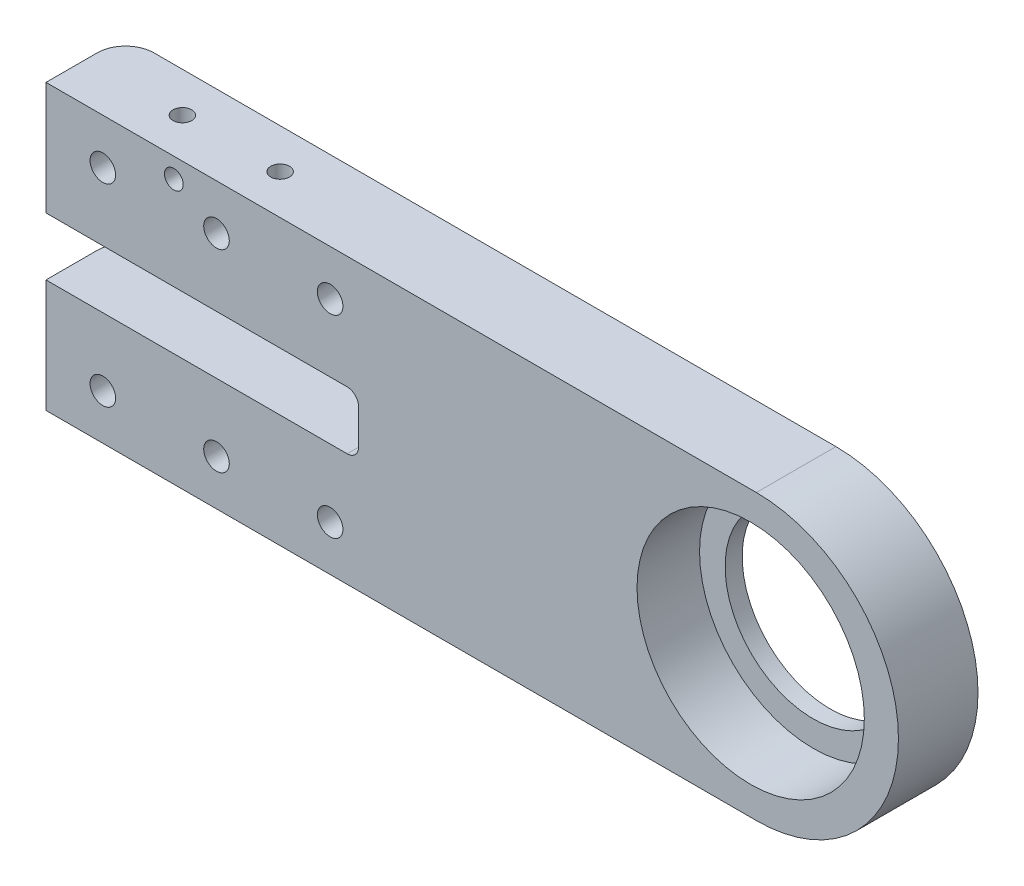
ISO-10303-21;
HEADER;
FILE_DESCRIPTION(('STEP AP214'),'2;1');
FILE_NAME('part.step','',(''),(''),'','','');
FILE_SCHEMA(('AUTOMOTIVE_DESIGN { 1 0 10303 214 1 1 1 1 }'));
ENDSEC;
DATA;
#1=APPLICATION_CONTEXT('core data for automotive mechanical design processes');
#2=APPLICATION_PROTOCOL_DEFINITION('international standard','automotive_design',2000,#1);
#3=PRODUCT_CONTEXT('',#1,'mechanical');
#4=PRODUCT('Part','Part','',(#3));
#5=PRODUCT_RELATED_PRODUCT_CATEGORY('part','',(#4));
#6=PRODUCT_DEFINITION_FORMATION('','',#4);
#7=PRODUCT_DEFINITION_CONTEXT('part definition',#1,'design');
#8=PRODUCT_DEFINITION('design','',#6,#7);
#9=PRODUCT_DEFINITION_SHAPE('','',#8);
#10=(LENGTH_UNIT() NAMED_UNIT(*) SI_UNIT(.MILLI.,.METRE.));
#11=(NAMED_UNIT(*) PLANE_ANGLE_UNIT() SI_UNIT($,.RADIAN.));
#12=(NAMED_UNIT(*) SI_UNIT($,.STERADIAN.) SOLID_ANGLE_UNIT());
#13=UNCERTAINTY_MEASURE_WITH_UNIT(LENGTH_MEASURE(1.E-05),#10,'distance_accuracy_value','');
#14=(GEOMETRIC_REPRESENTATION_CONTEXT(3) GLOBAL_UNCERTAINTY_ASSIGNED_CONTEXT((#13)) GLOBAL_UNIT_ASSIGNED_CONTEXT((#10,
#11,#12)) REPRESENTATION_CONTEXT('',''));
#15=CARTESIAN_POINT('',(0.,0.,0.));
#16=DIRECTION('',(0.,0.,1.));
#17=DIRECTION('',(1.,0.,0.));
#18=AXIS2_PLACEMENT_3D('',#15,#16,#17);
#19=CARTESIAN_POINT('',(0.,-50.,14.));
#20=DIRECTION('',(-1.,0.,0.));
#21=DIRECTION('',(0.,-1.,0.));
#22=AXIS2_PLACEMENT_3D('',#19,#20,#21);
#23=PLANE('',#22);
#24=DIRECTION('',(0.,0.,-1.));
#25=VECTOR('',#24,1.);
#26=CARTESIAN_POINT('',(0.,0.,14.));
#27=LINE('',#26,#25);
#28=CARTESIAN_POINT('',(0.,0.,14.));
#29=VERTEX_POINT('',#28);
#30=CARTESIAN_POINT('',(0.,0.,5.));
#31=VERTEX_POINT('',#30);
#32=EDGE_CURVE('E172',#29,#31,#27,.T.);
#33=ORIENTED_EDGE('',*,*,#32,.T.);
#34=DIRECTION('',(0.,1.,0.));
#35=VECTOR('',#34,1.);
#36=CARTESIAN_POINT('',(0.,-50.,5.));
#37=LINE('',#36,#35);
#38=CARTESIAN_POINT('',(0.,-19.8999999994651,5.));
#39=VERTEX_POINT('',#38);
#40=EDGE_CURVE('E40',#31,#39,#37,.F.);
#41=ORIENTED_EDGE('',*,*,#40,.T.);
#42=DIRECTION('',(0.,0.,1.));
#43=VECTOR('',#42,1.);
#44=CARTESIAN_POINT('',(0.,-19.8999999994651,0.));
#45=LINE('',#44,#43);
#46=CARTESIAN_POINT('',(0.,-19.8999999994651,14.));
#47=VERTEX_POINT('',#46);
#48=EDGE_CURVE('E131',#39,#47,#45,.T.);
#49=ORIENTED_EDGE('',*,*,#48,.T.);
#50=DIRECTION('',(0.,1.,0.));
#51=VECTOR('',#50,1.);
#52=CARTESIAN_POINT('',(0.,-50.,14.));
#53=LINE('',#52,#51);
#54=EDGE_CURVE('E150',#47,#29,#53,.T.);
#55=ORIENTED_EDGE('',*,*,#54,.T.);
#56=EDGE_LOOP('',(#33,#41,#49,#55));
#57=FACE_BOUND('',#56,.T.);
#58=ADVANCED_FACE('F32',(#57),#23,.T.);
#59=CARTESIAN_POINT('',(125.,-25.,14.));
#60=DIRECTION('',(0.,0.,-1.));
#61=DIRECTION('',(-1.,0.,0.));
#62=AXIS2_PLACEMENT_3D('',#59,#60,#61);
#63=CYLINDRICAL_SURFACE('',#62,25.);
#64=CARTESIAN_POINT('',(125.,-25.,0.));
#65=DIRECTION('',(0.,0.,-1.));
#66=DIRECTION('',(-1.,0.,0.));
#67=AXIS2_PLACEMENT_3D('',#64,#65,#66);
#68=CIRCLE('',#67,25.);
#69=CARTESIAN_POINT('',(125.,0.,0.));
#70=VERTEX_POINT('',#69);
#71=CARTESIAN_POINT('',(125.,-50.,0.));
#72=VERTEX_POINT('',#71);
#73=EDGE_CURVE('E159',#70,#72,#68,.T.);
#74=ORIENTED_EDGE('',*,*,#73,.F.);
#75=DIRECTION('',(0.,0.,-1.));
#76=VECTOR('',#75,1.);
#77=CARTESIAN_POINT('',(125.,0.,14.));
#78=LINE('',#77,#76);
#79=CARTESIAN_POINT('',(125.,0.,14.));
#80=VERTEX_POINT('',#79);
#81=EDGE_CURVE('E168',#80,#70,#78,.T.);
#82=ORIENTED_EDGE('',*,*,#81,.F.);
#83=CARTESIAN_POINT('',(125.,-25.,14.));
#84=DIRECTION('',(0.,0.,-1.));
#85=DIRECTION('',(-1.,0.,0.));
#86=AXIS2_PLACEMENT_3D('',#83,#84,#85);
#87=CIRCLE('',#86,25.);
#88=CARTESIAN_POINT('',(125.,-50.,14.));
#89=VERTEX_POINT('',#88);
#90=EDGE_CURVE('E167',#80,#89,#87,.T.);
#91=ORIENTED_EDGE('',*,*,#90,.T.);
#92=DIRECTION('',(0.,0.,-1.));
#93=VECTOR('',#92,1.);
#94=CARTESIAN_POINT('',(125.,-50.,14.));
#95=LINE('',#94,#93);
#96=EDGE_CURVE('E153',#89,#72,#95,.T.);
#97=ORIENTED_EDGE('',*,*,#96,.T.);
#98=EDGE_LOOP('',(#74,#82,#91,#97));
#99=FACE_BOUND('',#98,.T.);
#100=ADVANCED_FACE('F260',(#99),#63,.T.);
#101=CARTESIAN_POINT('',(0.,0.,14.));
#102=DIRECTION('',(0.,1.,0.));
#103=DIRECTION('',(0.,0.,1.));
#104=AXIS2_PLACEMENT_3D('',#101,#102,#103);
#105=PLANE('',#104);
#106=CARTESIAN_POINT('',(17.,0.,7.00000000000001));
#107=DIRECTION('',(0.,1.,0.));
#108=DIRECTION('',(0.,0.,1.));
#109=AXIS2_PLACEMENT_3D('',#106,#107,#108);
#110=CIRCLE('',#109,1.64999999999998);
#111=CARTESIAN_POINT('',(17.,0.,8.64999999999999));
#112=VERTEX_POINT('',#111);
#113=EDGE_CURVE('E367',#112,#112,#110,.T.);
#114=ORIENTED_EDGE('',*,*,#113,.F.);
#115=EDGE_LOOP('',(#114));
#116=FACE_BOUND('',#115,.T.);
#117=CARTESIAN_POINT('',(34.2,0.,7.00000000000001));
#118=DIRECTION('',(0.,1.,0.));
#119=DIRECTION('',(0.,0.,1.));
#120=AXIS2_PLACEMENT_3D('',#117,#118,#119);
#121=CIRCLE('',#120,1.64999999999998);
#122=CARTESIAN_POINT('',(34.2,0.,8.64999999999999));
#123=VERTEX_POINT('',#122);
#124=EDGE_CURVE('E373',#123,#123,#121,.T.);
#125=ORIENTED_EDGE('',*,*,#124,.F.);
#126=EDGE_LOOP('',(#125));
#127=FACE_BOUND('',#126,.T.);
#128=DIRECTION('',(1.,0.,0.));
#129=VECTOR('',#128,1.);
#130=CARTESIAN_POINT('',(0.,0.,0.));
#131=LINE('',#130,#129);
#132=CARTESIAN_POINT('',(5.,0.,0.));
#133=VERTEX_POINT('',#132);
#134=EDGE_CURVE('E165',#133,#70,#131,.T.);
#135=ORIENTED_EDGE('',*,*,#134,.F.);
#136=CARTESIAN_POINT('',(5.,0.,5.));
#137=DIRECTION('',(0.,1.,0.));
#138=DIRECTION('',(0.,0.,1.));
#139=AXIS2_PLACEMENT_3D('',#136,#137,#138);
#140=CIRCLE('',#139,5.);
#141=EDGE_CURVE('E54',#133,#31,#140,.T.);
#142=ORIENTED_EDGE('',*,*,#141,.T.);
#143=ORIENTED_EDGE('',*,*,#32,.F.);
#144=DIRECTION('',(1.,0.,0.));
#145=VECTOR('',#144,1.);
#146=CARTESIAN_POINT('',(0.,0.,14.));
#147=LINE('',#146,#145);
#148=EDGE_CURVE('E149',#29,#80,#147,.T.);
#149=ORIENTED_EDGE('',*,*,#148,.T.);
#150=ORIENTED_EDGE('',*,*,#81,.T.);
#151=EDGE_LOOP('',(#135,#142,#143,#149,#150));
#152=FACE_BOUND('',#151,.T.);
#153=ADVANCED_FACE('F265',(#116,#127,#152),#105,.T.);
#154=DIRECTION('',(0.,0.,1.));
#155=VECTOR('',#154,1.);
#156=CARTESIAN_POINT('',(0.,-30.0999999994651,0.));
#157=LINE('',#156,#155);
#158=CARTESIAN_POINT('',(0.,-30.0999999994651,5.));
#159=VERTEX_POINT('',#158);
#160=CARTESIAN_POINT('',(0.,-30.0999999994651,14.));
#161=VERTEX_POINT('',#160);
#162=EDGE_CURVE('E120',#159,#161,#157,.T.);
#163=ORIENTED_EDGE('',*,*,#162,.F.);
#164=DIRECTION('',(0.,1.,0.));
#165=VECTOR('',#164,1.);
#166=CARTESIAN_POINT('',(0.,-50.,5.));
#167=LINE('',#166,#165);
#168=CARTESIAN_POINT('',(0.,-50.,5.));
#169=VERTEX_POINT('',#168);
#170=EDGE_CURVE('E235',#159,#169,#167,.F.);
#171=ORIENTED_EDGE('',*,*,#170,.T.);
#172=DIRECTION('',(0.,0.,-1.));
#173=VECTOR('',#172,1.);
#174=CARTESIAN_POINT('',(0.,-50.,14.));
#175=LINE('',#174,#173);
#176=CARTESIAN_POINT('',(0.,-50.,14.));
#177=VERTEX_POINT('',#176);
#178=EDGE_CURVE('E148',#177,#169,#175,.T.);
#179=ORIENTED_EDGE('',*,*,#178,.F.);
#180=EDGE_CURVE('E139',#177,#161,#53,.T.);
#181=ORIENTED_EDGE('',*,*,#180,.T.);
#182=EDGE_LOOP('',(#163,#171,#179,#181));
#183=FACE_BOUND('',#182,.T.);
#184=ADVANCED_FACE('F146',(#183),#23,.T.);
#185=CARTESIAN_POINT('',(125.,-50.,14.));
#186=DIRECTION('',(0.,-1.,0.));
#187=DIRECTION('',(0.,0.,-1.));
#188=AXIS2_PLACEMENT_3D('',#185,#186,#187);
#189=PLANE('',#188);
#190=ORIENTED_EDGE('',*,*,#178,.T.);
#191=CARTESIAN_POINT('',(5.00000000000001,-50.,5.));
#192=DIRECTION('',(0.,-1.,0.));
#193=DIRECTION('',(0.,0.,-1.));
#194=AXIS2_PLACEMENT_3D('',#191,#192,#193);
#195=CIRCLE('',#194,5.);
#196=CARTESIAN_POINT('',(5.,-50.,0.));
#197=VERTEX_POINT('',#196);
#198=EDGE_CURVE('E237',#169,#197,#195,.T.);
#199=ORIENTED_EDGE('',*,*,#198,.T.);
#200=DIRECTION('',(-1.,0.,0.));
#201=VECTOR('',#200,1.);
#202=CARTESIAN_POINT('',(125.,-50.,0.));
#203=LINE('',#202,#201);
#204=EDGE_CURVE('E162',#72,#197,#203,.T.);
#205=ORIENTED_EDGE('',*,*,#204,.F.);
#206=ORIENTED_EDGE('',*,*,#96,.F.);
#207=DIRECTION('',(-1.,0.,0.));
#208=VECTOR('',#207,1.);
#209=CARTESIAN_POINT('',(125.,-50.,14.));
#210=LINE('',#209,#208);
#211=EDGE_CURVE('E155',#89,#177,#210,.T.);
#212=ORIENTED_EDGE('',*,*,#211,.T.);
#213=EDGE_LOOP('',(#190,#199,#205,#206,#212));
#214=FACE_BOUND('',#213,.T.);
#215=ADVANCED_FACE('F242',(#214),#189,.T.);
#216=CARTESIAN_POINT('',(125.,-25.,14.));
#217=DIRECTION('',(0.,0.,-1.));
#218=DIRECTION('',(-1.,0.,0.));
#219=AXIS2_PLACEMENT_3D('',#216,#217,#218);
#220=PLANE('',#219);
#221=CARTESIAN_POINT('',(123.999999994871,-24.9999999994651,14.));
#222=DIRECTION('',(0.,0.,1.));
#223=DIRECTION('',(1.,0.,0.));
#224=AXIS2_PLACEMENT_3D('',#221,#222,#223);
#225=CIRCLE('',#224,20.0000000051291);
#226=CARTESIAN_POINT('',(144.,-24.9999999994651,14.));
#227=VERTEX_POINT('',#226);
#228=EDGE_CURVE('E357',#227,#227,#225,.T.);
#229=ORIENTED_EDGE('',*,*,#228,.F.);
#230=EDGE_LOOP('',(#229));
#231=FACE_BOUND('',#230,.T.);
#232=CARTESIAN_POINT('',(22.5,-3.5,14.));
#233=DIRECTION('',(0.,0.,1.));
#234=DIRECTION('',(1.,0.,0.));
#235=AXIS2_PLACEMENT_3D('',#232,#233,#234);
#236=CIRCLE('',#235,1.64999999999998);
#237=CARTESIAN_POINT('',(24.15,-3.5,14.));
#238=VERTEX_POINT('',#237);
#239=EDGE_CURVE('E379',#238,#238,#236,.T.);
#240=ORIENTED_EDGE('',*,*,#239,.F.);
#241=EDGE_LOOP('',(#240));
#242=FACE_BOUND('',#241,.T.);
#243=CARTESIAN_POINT('',(10.,-8.,14.));
#244=DIRECTION('',(0.,0.,-1.));
#245=DIRECTION('',(-1.,0.,0.));
#246=AXIS2_PLACEMENT_3D('',#243,#244,#245);
#247=CIRCLE('',#246,2.24999999999997);
#248=CARTESIAN_POINT('',(7.75000000000003,-8.,14.));
#249=VERTEX_POINT('',#248);
#250=EDGE_CURVE('E385',#249,#249,#247,.T.);
#251=ORIENTED_EDGE('',*,*,#250,.T.);
#252=EDGE_LOOP('',(#251));
#253=FACE_BOUND('',#252,.T.);
#254=CARTESIAN_POINT('',(9.99999999999998,-42.,14.));
#255=DIRECTION('',(0.,0.,-1.));
#256=DIRECTION('',(-1.,0.,0.));
#257=AXIS2_PLACEMENT_3D('',#254,#255,#256);
#258=CIRCLE('',#257,2.24999999999997);
#259=CARTESIAN_POINT('',(7.75000000000002,-42.,14.));
#260=VERTEX_POINT('',#259);
#261=EDGE_CURVE('E388',#260,#260,#258,.T.);
#262=ORIENTED_EDGE('',*,*,#261,.T.);
#263=EDGE_LOOP('',(#262));
#264=FACE_BOUND('',#263,.T.);
#265=CARTESIAN_POINT('',(30.,-42.,14.));
#266=DIRECTION('',(0.,0.,-1.));
#267=DIRECTION('',(-1.,0.,0.));
#268=AXIS2_PLACEMENT_3D('',#265,#266,#267);
#269=CIRCLE('',#268,2.24999999999997);
#270=CARTESIAN_POINT('',(27.75,-42.,14.));
#271=VERTEX_POINT('',#270);
#272=EDGE_CURVE('E391',#271,#271,#269,.T.);
#273=ORIENTED_EDGE('',*,*,#272,.T.);
#274=EDGE_LOOP('',(#273));
#275=FACE_BOUND('',#274,.T.);
#276=CARTESIAN_POINT('',(30.,-8.,14.));
#277=DIRECTION('',(0.,0.,-1.));
#278=DIRECTION('',(-1.,0.,0.));
#279=AXIS2_PLACEMENT_3D('',#276,#277,#278);
#280=CIRCLE('',#279,2.24999999999996);
#281=CARTESIAN_POINT('',(27.75,-8.,14.));
#282=VERTEX_POINT('',#281);
#283=EDGE_CURVE('E394',#282,#282,#280,.T.);
#284=ORIENTED_EDGE('',*,*,#283,.T.);
#285=EDGE_LOOP('',(#284));
#286=FACE_BOUND('',#285,.T.);
#287=CARTESIAN_POINT('',(50.,-8.00000000000001,14.));
#288=DIRECTION('',(0.,0.,-1.));
#289=DIRECTION('',(-1.,0.,0.));
#290=AXIS2_PLACEMENT_3D('',#287,#288,#289);
#291=CIRCLE('',#290,2.24999999999997);
#292=CARTESIAN_POINT('',(47.75,-8.00000000000001,14.));
#293=VERTEX_POINT('',#292);
#294=EDGE_CURVE('E397',#293,#293,#291,.T.);
#295=ORIENTED_EDGE('',*,*,#294,.T.);
#296=EDGE_LOOP('',(#295));
#297=FACE_BOUND('',#296,.T.);
#298=CARTESIAN_POINT('',(50.,-42.,14.));
#299=DIRECTION('',(0.,0.,-1.));
#300=DIRECTION('',(-1.,0.,0.));
#301=AXIS2_PLACEMENT_3D('',#298,#299,#300);
#302=CIRCLE('',#301,2.24999999999997);
#303=CARTESIAN_POINT('',(47.75,-42.,14.));
#304=VERTEX_POINT('',#303);
#305=EDGE_CURVE('E144',#304,#304,#302,.T.);
#306=ORIENTED_EDGE('',*,*,#305,.T.);
#307=EDGE_LOOP('',(#306));
#308=FACE_BOUND('',#307,.T.);
#309=ORIENTED_EDGE('',*,*,#54,.F.);
#310=DIRECTION('',(-1.,0.,0.));
#311=VECTOR('',#310,1.);
#312=CARTESIAN_POINT('',(55.,-19.8999999994651,14.));
#313=LINE('',#312,#311);
#314=CARTESIAN_POINT('',(53.,-19.8999999994651,14.));
#315=VERTEX_POINT('',#314);
#316=EDGE_CURVE('E405',#315,#47,#313,.T.);
#317=ORIENTED_EDGE('',*,*,#316,.F.);
#318=CARTESIAN_POINT('',(53.,-21.8999999994651,14.));
#319=DIRECTION('',(0.,0.,-1.));
#320=DIRECTION('',(-1.,0.,0.));
#321=AXIS2_PLACEMENT_3D('',#318,#319,#320);
#322=CIRCLE('',#321,2.);
#323=CARTESIAN_POINT('',(55.,-21.8999999994651,14.));
#324=VERTEX_POINT('',#323);
#325=EDGE_CURVE('E221',#315,#324,#322,.T.);
#326=ORIENTED_EDGE('',*,*,#325,.T.);
#327=DIRECTION('',(0.,1.,0.));
#328=VECTOR('',#327,1.);
#329=CARTESIAN_POINT('',(55.,-30.0999999994651,14.));
#330=LINE('',#329,#328);
#331=CARTESIAN_POINT('',(55.,-28.0999999994651,14.));
#332=VERTEX_POINT('',#331);
#333=EDGE_CURVE('E143',#332,#324,#330,.T.);
#334=ORIENTED_EDGE('',*,*,#333,.F.);
#335=CARTESIAN_POINT('',(53.,-28.0999999994651,14.));
#336=DIRECTION('',(0.,0.,-1.));
#337=DIRECTION('',(-1.,0.,0.));
#338=AXIS2_PLACEMENT_3D('',#335,#336,#337);
#339=CIRCLE('',#338,2.);
#340=CARTESIAN_POINT('',(53.,-30.0999999994651,14.));
#341=VERTEX_POINT('',#340);
#342=EDGE_CURVE('E142',#332,#341,#339,.T.);
#343=ORIENTED_EDGE('',*,*,#342,.T.);
#344=DIRECTION('',(1.,0.,0.));
#345=VECTOR('',#344,1.);
#346=CARTESIAN_POINT('',(0.,-30.0999999994651,14.));
#347=LINE('',#346,#345);
#348=EDGE_CURVE('E125',#161,#341,#347,.T.);
#349=ORIENTED_EDGE('',*,*,#348,.F.);
#350=ORIENTED_EDGE('',*,*,#180,.F.);
#351=ORIENTED_EDGE('',*,*,#211,.F.);
#352=ORIENTED_EDGE('',*,*,#90,.F.);
#353=ORIENTED_EDGE('',*,*,#148,.F.);
#354=EDGE_LOOP('',(#309,#317,#326,#334,#343,#349,#350,#351,#352,#353));
#355=FACE_BOUND('',#354,.T.);
#356=ADVANCED_FACE('F137',(#231,#242,#253,#264,#275,#286,#297,#308,#355),#220,.F.);
#357=CARTESIAN_POINT('',(125.,-25.,0.));
#358=DIRECTION('',(0.,0.,-1.));
#359=DIRECTION('',(-1.,0.,0.));
#360=AXIS2_PLACEMENT_3D('',#357,#358,#359);
#361=PLANE('',#360);
#362=CARTESIAN_POINT('',(30.,-42.,0.));
#363=DIRECTION('',(0.,0.,-1.));
#364=DIRECTION('',(-1.,0.,0.));
#365=AXIS2_PLACEMENT_3D('',#362,#363,#364);
#366=CIRCLE('',#365,4.70000000001612);
#367=CARTESIAN_POINT('',(25.2999999999839,-42.,0.));
#368=VERTEX_POINT('',#367);
#369=EDGE_CURVE('E193',#368,#368,#366,.F.);
#370=ORIENTED_EDGE('',*,*,#369,.T.);
#371=EDGE_LOOP('',(#370));
#372=FACE_BOUND('',#371,.T.);
#373=CARTESIAN_POINT('',(9.99999999999998,-42.,0.));
#374=DIRECTION('',(0.,0.,-1.));
#375=DIRECTION('',(-1.,0.,0.));
#376=AXIS2_PLACEMENT_3D('',#373,#374,#375);
#377=CIRCLE('',#376,4.70000000001608);
#378=CARTESIAN_POINT('',(5.2999999999839,-42.,0.));
#379=VERTEX_POINT('',#378);
#380=EDGE_CURVE('E190',#379,#379,#377,.F.);
#381=ORIENTED_EDGE('',*,*,#380,.T.);
#382=EDGE_LOOP('',(#381));
#383=FACE_BOUND('',#382,.T.);
#384=CARTESIAN_POINT('',(50.,-42.,0.));
#385=DIRECTION('',(0.,0.,-1.));
#386=DIRECTION('',(-1.,0.,0.));
#387=AXIS2_PLACEMENT_3D('',#384,#385,#386);
#388=CIRCLE('',#387,4.70000000001608);
#389=CARTESIAN_POINT('',(45.2999999999839,-42.,0.));
#390=VERTEX_POINT('',#389);
#391=EDGE_CURVE('E187',#390,#390,#388,.F.);
#392=ORIENTED_EDGE('',*,*,#391,.T.);
#393=EDGE_LOOP('',(#392));
#394=FACE_BOUND('',#393,.T.);
#395=CARTESIAN_POINT('',(30.,-8.,0.));
#396=DIRECTION('',(0.,0.,-1.));
#397=DIRECTION('',(-1.,0.,0.));
#398=AXIS2_PLACEMENT_3D('',#395,#396,#397);
#399=CIRCLE('',#398,4.70000000001607);
#400=CARTESIAN_POINT('',(25.2999999999839,-8.,0.));
#401=VERTEX_POINT('',#400);
#402=EDGE_CURVE('E184',#401,#401,#399,.F.);
#403=ORIENTED_EDGE('',*,*,#402,.T.);
#404=EDGE_LOOP('',(#403));
#405=FACE_BOUND('',#404,.T.);
#406=CARTESIAN_POINT('',(10.,-8.,0.));
#407=DIRECTION('',(0.,0.,-1.));
#408=DIRECTION('',(-1.,0.,0.));
#409=AXIS2_PLACEMENT_3D('',#406,#407,#408);
#410=CIRCLE('',#409,4.70000000001612);
#411=CARTESIAN_POINT('',(5.29999999998388,-8.,0.));
#412=VERTEX_POINT('',#411);
#413=EDGE_CURVE('E181',#412,#412,#410,.F.);
#414=ORIENTED_EDGE('',*,*,#413,.T.);
#415=EDGE_LOOP('',(#414));
#416=FACE_BOUND('',#415,.T.);
#417=CARTESIAN_POINT('',(50.,-8.00000000000001,0.));
#418=DIRECTION('',(0.,0.,-1.));
#419=DIRECTION('',(-1.,0.,0.));
#420=AXIS2_PLACEMENT_3D('',#417,#418,#419);
#421=CIRCLE('',#420,4.70000000001608);
#422=CARTESIAN_POINT('',(45.2999999999839,-8.00000000000001,0.));
#423=VERTEX_POINT('',#422);
#424=EDGE_CURVE('E178',#423,#423,#421,.F.);
#425=ORIENTED_EDGE('',*,*,#424,.T.);
#426=EDGE_LOOP('',(#425));
#427=FACE_BOUND('',#426,.T.);
#428=CARTESIAN_POINT('',(123.999999994871,-24.9999999994651,0.));
#429=DIRECTION('',(0.,0.,1.));
#430=DIRECTION('',(1.,0.,0.));
#431=AXIS2_PLACEMENT_3D('',#428,#429,#430);
#432=CIRCLE('',#431,15.500000004746);
#433=CARTESIAN_POINT('',(139.499999999617,-24.9999999994651,0.));
#434=VERTEX_POINT('',#433);
#435=EDGE_CURVE('E364',#434,#434,#432,.T.);
#436=ORIENTED_EDGE('',*,*,#435,.T.);
#437=EDGE_LOOP('',(#436));
#438=FACE_BOUND('',#437,.T.);
#439=CARTESIAN_POINT('',(22.5,-3.5,0.));
#440=DIRECTION('',(0.,0.,1.));
#441=DIRECTION('',(1.,0.,0.));
#442=AXIS2_PLACEMENT_3D('',#439,#440,#441);
#443=CIRCLE('',#442,1.64999999999998);
#444=CARTESIAN_POINT('',(24.15,-3.5,0.));
#445=VERTEX_POINT('',#444);
#446=EDGE_CURVE('E382',#445,#445,#443,.T.);
#447=ORIENTED_EDGE('',*,*,#446,.T.);
#448=EDGE_LOOP('',(#447));
#449=FACE_BOUND('',#448,.T.);
#450=ORIENTED_EDGE('',*,*,#204,.T.);
#451=DIRECTION('',(0.,1.,0.));
#452=VECTOR('',#451,1.);
#453=CARTESIAN_POINT('',(5.,-25.,0.));
#454=LINE('',#453,#452);
#455=CARTESIAN_POINT('',(5.,-30.0999999994651,0.));
#456=VERTEX_POINT('',#455);
#457=EDGE_CURVE('E231',#197,#456,#454,.T.);
#458=ORIENTED_EDGE('',*,*,#457,.T.);
#459=DIRECTION('',(1.,0.,0.));
#460=VECTOR('',#459,1.);
#461=CARTESIAN_POINT('',(0.,-30.0999999994651,0.));
#462=LINE('',#461,#460);
#463=CARTESIAN_POINT('',(53.,-30.0999999994651,0.));
#464=VERTEX_POINT('',#463);
#465=EDGE_CURVE('E402',#456,#464,#462,.T.);
#466=ORIENTED_EDGE('',*,*,#465,.T.);
#467=CARTESIAN_POINT('',(53.,-28.0999999994651,0.));
#468=DIRECTION('',(0.,0.,-1.));
#469=DIRECTION('',(-1.,0.,0.));
#470=AXIS2_PLACEMENT_3D('',#467,#468,#469);
#471=CIRCLE('',#470,2.);
#472=CARTESIAN_POINT('',(55.,-28.0999999994651,0.));
#473=VERTEX_POINT('',#472);
#474=EDGE_CURVE('E226',#464,#473,#471,.F.);
#475=ORIENTED_EDGE('',*,*,#474,.T.);
#476=DIRECTION('',(0.,1.,0.));
#477=VECTOR('',#476,1.);
#478=CARTESIAN_POINT('',(55.,-30.0999999994651,0.));
#479=LINE('',#478,#477);
#480=CARTESIAN_POINT('',(55.,-21.8999999994651,0.));
#481=VERTEX_POINT('',#480);
#482=EDGE_CURVE('E404',#473,#481,#479,.T.);
#483=ORIENTED_EDGE('',*,*,#482,.T.);
#484=CARTESIAN_POINT('',(53.,-21.8999999994651,0.));
#485=DIRECTION('',(0.,0.,-1.));
#486=DIRECTION('',(-1.,0.,0.));
#487=AXIS2_PLACEMENT_3D('',#484,#485,#486);
#488=CIRCLE('',#487,2.);
#489=CARTESIAN_POINT('',(53.,-19.8999999994651,0.));
#490=VERTEX_POINT('',#489);
#491=EDGE_CURVE('E223',#481,#490,#488,.F.);
#492=ORIENTED_EDGE('',*,*,#491,.T.);
#493=DIRECTION('',(-1.,0.,0.));
#494=VECTOR('',#493,1.);
#495=CARTESIAN_POINT('',(55.,-19.8999999994651,0.));
#496=LINE('',#495,#494);
#497=CARTESIAN_POINT('',(5.,-19.8999999994651,0.));
#498=VERTEX_POINT('',#497);
#499=EDGE_CURVE('E132',#490,#498,#496,.T.);
#500=ORIENTED_EDGE('',*,*,#499,.T.);
#501=DIRECTION('',(0.,1.,0.));
#502=VECTOR('',#501,1.);
#503=CARTESIAN_POINT('',(5.,-25.,0.));
#504=LINE('',#503,#502);
#505=EDGE_CURVE('E228',#498,#133,#504,.T.);
#506=ORIENTED_EDGE('',*,*,#505,.T.);
#507=ORIENTED_EDGE('',*,*,#134,.T.);
#508=ORIENTED_EDGE('',*,*,#73,.T.);
#509=EDGE_LOOP('',(#450,#458,#466,#475,#483,#492,#500,#506,#507,#508));
#510=FACE_BOUND('',#509,.T.);
#511=ADVANCED_FACE('F246',(#372,#383,#394,#405,#416,#427,#438,#449,#510),#361,.T.);
#512=CARTESIAN_POINT('',(55.,-19.8999999994651,0.));
#513=DIRECTION('',(0.,1.,0.));
#514=DIRECTION('',(-1.,0.,0.));
#515=AXIS2_PLACEMENT_3D('',#512,#513,#514);
#516=PLANE('',#515);
#517=CARTESIAN_POINT('',(17.,-19.8999999994651,7.00000000000001));
#518=DIRECTION('',(0.,1.,0.));
#519=DIRECTION('',(-1.,0.,0.));
#520=AXIS2_PLACEMENT_3D('',#517,#518,#519);
#521=CIRCLE('',#520,1.64999999999998);
#522=CARTESIAN_POINT('',(15.35,-19.8999999994651,7.00000000000001));
#523=VERTEX_POINT('',#522);
#524=EDGE_CURVE('E370',#523,#523,#521,.T.);
#525=ORIENTED_EDGE('',*,*,#524,.T.);
#526=EDGE_LOOP('',(#525));
#527=FACE_BOUND('',#526,.T.);
#528=CARTESIAN_POINT('',(34.2,-19.8999999994651,7.00000000000001));
#529=DIRECTION('',(0.,1.,0.));
#530=DIRECTION('',(-1.,0.,0.));
#531=AXIS2_PLACEMENT_3D('',#528,#529,#530);
#532=CIRCLE('',#531,1.64999999999998);
#533=CARTESIAN_POINT('',(32.55,-19.8999999994651,7.00000000000001));
#534=VERTEX_POINT('',#533);
#535=EDGE_CURVE('E376',#534,#534,#532,.T.);
#536=ORIENTED_EDGE('',*,*,#535,.T.);
#537=EDGE_LOOP('',(#536));
#538=FACE_BOUND('',#537,.T.);
#539=ORIENTED_EDGE('',*,*,#48,.F.);
#540=CARTESIAN_POINT('',(5.,-19.8999999994651,5.));
#541=DIRECTION('',(0.,1.,0.));
#542=DIRECTION('',(-1.,0.,0.));
#543=AXIS2_PLACEMENT_3D('',#540,#541,#542);
#544=CIRCLE('',#543,5.);
#545=EDGE_CURVE('E11',#39,#498,#544,.F.);
#546=ORIENTED_EDGE('',*,*,#545,.T.);
#547=ORIENTED_EDGE('',*,*,#499,.F.);
#548=DIRECTION('',(0.,0.,1.));
#549=VECTOR('',#548,1.);
#550=CARTESIAN_POINT('',(53.,-19.8999999994651,14.));
#551=LINE('',#550,#549);
#552=EDGE_CURVE('E211',#490,#315,#551,.T.);
#553=ORIENTED_EDGE('',*,*,#552,.T.);
#554=ORIENTED_EDGE('',*,*,#316,.T.);
#555=EDGE_LOOP('',(#539,#546,#547,#553,#554));
#556=FACE_BOUND('',#555,.T.);
#557=ADVANCED_FACE('F283',(#527,#538,#556),#516,.F.);
#558=CARTESIAN_POINT('',(55.,-30.0999999994651,0.));
#559=DIRECTION('',(1.,0.,0.));
#560=DIRECTION('',(0.,0.,-1.));
#561=AXIS2_PLACEMENT_3D('',#558,#559,#560);
#562=PLANE('',#561);
#563=ORIENTED_EDGE('',*,*,#333,.T.);
#564=DIRECTION('',(0.,0.,1.));
#565=VECTOR('',#564,1.);
#566=CARTESIAN_POINT('',(55.,-21.8999999994651,0.));
#567=LINE('',#566,#565);
#568=EDGE_CURVE('E217',#324,#481,#567,.F.);
#569=ORIENTED_EDGE('',*,*,#568,.T.);
#570=ORIENTED_EDGE('',*,*,#482,.F.);
#571=DIRECTION('',(0.,0.,1.));
#572=VECTOR('',#571,1.);
#573=CARTESIAN_POINT('',(55.,-28.0999999994651,14.));
#574=LINE('',#573,#572);
#575=EDGE_CURVE('E214',#473,#332,#574,.T.);
#576=ORIENTED_EDGE('',*,*,#575,.T.);
#577=EDGE_LOOP('',(#563,#569,#570,#576));
#578=FACE_BOUND('',#577,.T.);
#579=ADVANCED_FACE('F291',(#578),#562,.F.);
#580=CARTESIAN_POINT('',(0.,-30.0999999994651,0.));
#581=DIRECTION('',(0.,-1.,0.));
#582=DIRECTION('',(0.,0.,-1.));
#583=AXIS2_PLACEMENT_3D('',#580,#581,#582);
#584=PLANE('',#583);
#585=ORIENTED_EDGE('',*,*,#465,.F.);
#586=CARTESIAN_POINT('',(5.,-30.0999999994651,5.));
#587=DIRECTION('',(0.,-1.,0.));
#588=DIRECTION('',(0.,0.,-1.));
#589=AXIS2_PLACEMENT_3D('',#586,#587,#588);
#590=CIRCLE('',#589,5.);
#591=EDGE_CURVE('E127',#456,#159,#590,.F.);
#592=ORIENTED_EDGE('',*,*,#591,.T.);
#593=ORIENTED_EDGE('',*,*,#162,.T.);
#594=ORIENTED_EDGE('',*,*,#348,.T.);
#595=DIRECTION('',(0.,0.,1.));
#596=VECTOR('',#595,1.);
#597=CARTESIAN_POINT('',(53.,-30.0999999994651,0.));
#598=LINE('',#597,#596);
#599=EDGE_CURVE('E219',#341,#464,#598,.F.);
#600=ORIENTED_EDGE('',*,*,#599,.T.);
#601=EDGE_LOOP('',(#585,#592,#593,#594,#600));
#602=FACE_BOUND('',#601,.T.);
#603=ADVANCED_FACE('F123',(#602),#584,.F.);
#604=CARTESIAN_POINT('',(50.,-42.,0.));
#605=DIRECTION('',(0.,0.,-1.));
#606=DIRECTION('',(-1.,0.,0.));
#607=AXIS2_PLACEMENT_3D('',#604,#605,#606);
#608=CYLINDRICAL_SURFACE('',#607,2.24999999999997);
#609=CARTESIAN_POINT('',(50.,-42.,2.4499999999024));
#610=DIRECTION('',(0.,0.,-1.));
#611=DIRECTION('',(-1.,0.,0.));
#612=AXIS2_PLACEMENT_3D('',#609,#610,#611);
#613=CIRCLE('',#612,2.24999999999997);
#614=CARTESIAN_POINT('',(47.75,-42.,2.4499999999024));
#615=VERTEX_POINT('',#614);
#616=EDGE_CURVE('E199',#615,#615,#613,.T.);
#617=ORIENTED_EDGE('',*,*,#616,.T.);
#618=EDGE_LOOP('',(#617));
#619=FACE_BOUND('',#618,.T.);
#620=ORIENTED_EDGE('',*,*,#305,.F.);
#621=EDGE_LOOP('',(#620));
#622=FACE_BOUND('',#621,.T.);
#623=ADVANCED_FACE('F290',(#619,#622),#608,.F.);
#624=CARTESIAN_POINT('',(50.,-8.00000000000001,0.));
#625=DIRECTION('',(0.,0.,-1.));
#626=DIRECTION('',(-1.,0.,0.));
#627=AXIS2_PLACEMENT_3D('',#624,#625,#626);
#628=CYLINDRICAL_SURFACE('',#627,2.24999999999997);
#629=CARTESIAN_POINT('',(50.,-8.00000000000001,2.4499999999024));
#630=DIRECTION('',(0.,0.,-1.));
#631=DIRECTION('',(-1.,0.,0.));
#632=AXIS2_PLACEMENT_3D('',#629,#630,#631);
#633=CIRCLE('',#632,2.24999999999997);
#634=CARTESIAN_POINT('',(47.75,-8.00000000000001,2.4499999999024));
#635=VERTEX_POINT('',#634);
#636=EDGE_CURVE('E208',#635,#635,#633,.T.);
#637=ORIENTED_EDGE('',*,*,#636,.T.);
#638=EDGE_LOOP('',(#637));
#639=FACE_BOUND('',#638,.T.);
#640=ORIENTED_EDGE('',*,*,#294,.F.);
#641=EDGE_LOOP('',(#640));
#642=FACE_BOUND('',#641,.T.);
#643=ADVANCED_FACE('F300',(#639,#642),#628,.F.);
#644=CARTESIAN_POINT('',(30.,-8.,0.));
#645=DIRECTION('',(0.,0.,-1.));
#646=DIRECTION('',(-1.,0.,0.));
#647=AXIS2_PLACEMENT_3D('',#644,#645,#646);
#648=CYLINDRICAL_SURFACE('',#647,2.24999999999996);
#649=CARTESIAN_POINT('',(30.,-8.,2.44999999990241));
#650=DIRECTION('',(0.,0.,-1.));
#651=DIRECTION('',(-1.,0.,0.));
#652=AXIS2_PLACEMENT_3D('',#649,#650,#651);
#653=CIRCLE('',#652,2.24999999999996);
#654=CARTESIAN_POINT('',(27.75,-8.,2.44999999990241));
#655=VERTEX_POINT('',#654);
#656=EDGE_CURVE('E202',#655,#655,#653,.T.);
#657=ORIENTED_EDGE('',*,*,#656,.T.);
#658=EDGE_LOOP('',(#657));
#659=FACE_BOUND('',#658,.T.);
#660=ORIENTED_EDGE('',*,*,#283,.F.);
#661=EDGE_LOOP('',(#660));
#662=FACE_BOUND('',#661,.T.);
#663=ADVANCED_FACE('F304',(#659,#662),#648,.F.);
#664=CARTESIAN_POINT('',(30.,-42.,0.));
#665=DIRECTION('',(0.,0.,-1.));
#666=DIRECTION('',(-1.,0.,0.));
#667=AXIS2_PLACEMENT_3D('',#664,#665,#666);
#668=CYLINDRICAL_SURFACE('',#667,2.24999999999997);
#669=CARTESIAN_POINT('',(30.,-42.,2.44999999990245));
#670=DIRECTION('',(0.,0.,-1.));
#671=DIRECTION('',(-1.,0.,0.));
#672=AXIS2_PLACEMENT_3D('',#669,#670,#671);
#673=CIRCLE('',#672,2.24999999999997);
#674=CARTESIAN_POINT('',(27.75,-42.,2.44999999990245));
#675=VERTEX_POINT('',#674);
#676=EDGE_CURVE('E171',#675,#675,#673,.T.);
#677=ORIENTED_EDGE('',*,*,#676,.T.);
#678=EDGE_LOOP('',(#677));
#679=FACE_BOUND('',#678,.T.);
#680=ORIENTED_EDGE('',*,*,#272,.F.);
#681=EDGE_LOOP('',(#680));
#682=FACE_BOUND('',#681,.T.);
#683=ADVANCED_FACE('F308',(#679,#682),#668,.F.);
#684=CARTESIAN_POINT('',(9.99999999999998,-42.,0.));
#685=DIRECTION('',(0.,0.,-1.));
#686=DIRECTION('',(-1.,0.,0.));
#687=AXIS2_PLACEMENT_3D('',#684,#685,#686);
#688=CYLINDRICAL_SURFACE('',#687,2.24999999999997);
#689=CARTESIAN_POINT('',(9.99999999999998,-42.,2.4499999999024));
#690=DIRECTION('',(0.,0.,-1.));
#691=DIRECTION('',(-1.,0.,0.));
#692=AXIS2_PLACEMENT_3D('',#689,#690,#691);
#693=CIRCLE('',#692,2.24999999999997);
#694=CARTESIAN_POINT('',(7.75000000000002,-42.,2.4499999999024));
#695=VERTEX_POINT('',#694);
#696=EDGE_CURVE('E196',#695,#695,#693,.T.);
#697=ORIENTED_EDGE('',*,*,#696,.T.);
#698=EDGE_LOOP('',(#697));
#699=FACE_BOUND('',#698,.T.);
#700=ORIENTED_EDGE('',*,*,#261,.F.);
#701=EDGE_LOOP('',(#700));
#702=FACE_BOUND('',#701,.T.);
#703=ADVANCED_FACE('F312',(#699,#702),#688,.F.);
#704=CARTESIAN_POINT('',(10.,-8.,0.));
#705=DIRECTION('',(0.,0.,-1.));
#706=DIRECTION('',(-1.,0.,0.));
#707=AXIS2_PLACEMENT_3D('',#704,#705,#706);
#708=CYLINDRICAL_SURFACE('',#707,2.24999999999997);
#709=CARTESIAN_POINT('',(10.,-8.,2.44999999990245));
#710=DIRECTION('',(0.,0.,-1.));
#711=DIRECTION('',(-1.,0.,0.));
#712=AXIS2_PLACEMENT_3D('',#709,#710,#711);
#713=CIRCLE('',#712,2.24999999999997);
#714=CARTESIAN_POINT('',(7.75000000000003,-8.,2.44999999990245));
#715=VERTEX_POINT('',#714);
#716=EDGE_CURVE('E205',#715,#715,#713,.T.);
#717=ORIENTED_EDGE('',*,*,#716,.T.);
#718=EDGE_LOOP('',(#717));
#719=FACE_BOUND('',#718,.T.);
#720=ORIENTED_EDGE('',*,*,#250,.F.);
#721=EDGE_LOOP('',(#720));
#722=FACE_BOUND('',#721,.T.);
#723=ADVANCED_FACE('F316',(#719,#722),#708,.F.);
#724=CARTESIAN_POINT('',(22.5,-3.5,14.));
#725=DIRECTION('',(0.,0.,1.));
#726=DIRECTION('',(1.,0.,0.));
#727=AXIS2_PLACEMENT_3D('',#724,#725,#726);
#728=CYLINDRICAL_SURFACE('',#727,1.64999999999998);
#729=ORIENTED_EDGE('',*,*,#446,.F.);
#730=EDGE_LOOP('',(#729));
#731=FACE_BOUND('',#730,.T.);
#732=ORIENTED_EDGE('',*,*,#239,.T.);
#733=EDGE_LOOP('',(#732));
#734=FACE_BOUND('',#733,.T.);
#735=ADVANCED_FACE('F320',(#731,#734),#728,.F.);
#736=CARTESIAN_POINT('',(34.2,0.,7.00000000000001));
#737=DIRECTION('',(0.,1.,0.));
#738=DIRECTION('',(0.,0.,1.));
#739=AXIS2_PLACEMENT_3D('',#736,#737,#738);
#740=CYLINDRICAL_SURFACE('',#739,1.64999999999998);
#741=ORIENTED_EDGE('',*,*,#535,.F.);
#742=EDGE_LOOP('',(#741));
#743=FACE_BOUND('',#742,.T.);
#744=ORIENTED_EDGE('',*,*,#124,.T.);
#745=EDGE_LOOP('',(#744));
#746=FACE_BOUND('',#745,.T.);
#747=ADVANCED_FACE('F324',(#743,#746),#740,.F.);
#748=CARTESIAN_POINT('',(17.,0.,7.00000000000001));
#749=DIRECTION('',(0.,1.,0.));
#750=DIRECTION('',(0.,0.,1.));
#751=AXIS2_PLACEMENT_3D('',#748,#749,#750);
#752=CYLINDRICAL_SURFACE('',#751,1.64999999999998);
#753=ORIENTED_EDGE('',*,*,#524,.F.);
#754=EDGE_LOOP('',(#753));
#755=FACE_BOUND('',#754,.T.);
#756=ORIENTED_EDGE('',*,*,#113,.T.);
#757=EDGE_LOOP('',(#756));
#758=FACE_BOUND('',#757,.T.);
#759=ADVANCED_FACE('F328',(#755,#758),#752,.F.);
#760=CARTESIAN_POINT('',(123.999999994871,-24.9999999994651,14.));
#761=DIRECTION('',(0.,0.,1.));
#762=DIRECTION('',(1.,0.,0.));
#763=AXIS2_PLACEMENT_3D('',#760,#761,#762);
#764=CYLINDRICAL_SURFACE('',#763,15.500000004746);
#765=ORIENTED_EDGE('',*,*,#435,.F.);
#766=EDGE_LOOP('',(#765));
#767=FACE_BOUND('',#766,.T.);
#768=CARTESIAN_POINT('',(123.999999994871,-24.9999999994651,3.));
#769=DIRECTION('',(0.,0.,1.));
#770=DIRECTION('',(1.,0.,0.));
#771=AXIS2_PLACEMENT_3D('',#768,#769,#770);
#772=CIRCLE('',#771,15.500000004746);
#773=CARTESIAN_POINT('',(139.499999999617,-24.9999999994651,3.));
#774=VERTEX_POINT('',#773);
#775=EDGE_CURVE('E359',#774,#774,#772,.T.);
#776=ORIENTED_EDGE('',*,*,#775,.T.);
#777=EDGE_LOOP('',(#776));
#778=FACE_BOUND('',#777,.T.);
#779=ADVANCED_FACE('F332',(#767,#778),#764,.F.);
#780=CARTESIAN_POINT('',(139.499999999617,-24.9999999994651,3.));
#781=DIRECTION('',(0.,0.,-1.));
#782=DIRECTION('',(-1.,0.,0.));
#783=AXIS2_PLACEMENT_3D('',#780,#781,#782);
#784=PLANE('',#783);
#785=ORIENTED_EDGE('',*,*,#775,.F.);
#786=EDGE_LOOP('',(#785));
#787=FACE_BOUND('',#786,.T.);
#788=CARTESIAN_POINT('',(123.999999994871,-24.9999999994651,3.));
#789=DIRECTION('',(0.,0.,1.));
#790=DIRECTION('',(1.,0.,0.));
#791=AXIS2_PLACEMENT_3D('',#788,#789,#790);
#792=CIRCLE('',#791,20.0000000051291);
#793=CARTESIAN_POINT('',(144.,-24.9999999994651,3.));
#794=VERTEX_POINT('',#793);
#795=EDGE_CURVE('E354',#794,#794,#792,.T.);
#796=ORIENTED_EDGE('',*,*,#795,.T.);
#797=EDGE_LOOP('',(#796));
#798=FACE_BOUND('',#797,.T.);
#799=ADVANCED_FACE('F336',(#787,#798),#784,.F.);
#800=CARTESIAN_POINT('',(123.999999994871,-24.9999999994651,14.));
#801=DIRECTION('',(0.,0.,1.));
#802=DIRECTION('',(1.,0.,0.));
#803=AXIS2_PLACEMENT_3D('',#800,#801,#802);
#804=CYLINDRICAL_SURFACE('',#803,20.0000000051291);
#805=ORIENTED_EDGE('',*,*,#795,.F.);
#806=EDGE_LOOP('',(#805));
#807=FACE_BOUND('',#806,.T.);
#808=ORIENTED_EDGE('',*,*,#228,.T.);
#809=EDGE_LOOP('',(#808));
#810=FACE_BOUND('',#809,.T.);
#811=ADVANCED_FACE('F340',(#807,#810),#804,.F.);
#812=CARTESIAN_POINT('',(30.,-42.,2.44999999990245));
#813=DIRECTION('',(0.,0.,-1.));
#814=DIRECTION('',(-1.,0.,0.));
#815=AXIS2_PLACEMENT_3D('',#812,#813,#814);
#816=CONICAL_SURFACE('',#815,2.24999999999997,0.785398163420654);
#817=ORIENTED_EDGE('',*,*,#369,.F.);
#818=EDGE_LOOP('',(#817));
#819=FACE_BOUND('',#818,.T.);
#820=ORIENTED_EDGE('',*,*,#676,.F.);
#821=EDGE_LOOP('',(#820));
#822=FACE_BOUND('',#821,.T.);
#823=ADVANCED_FACE('F343',(#819,#822),#816,.F.);
#824=CARTESIAN_POINT('',(9.99999999999998,-42.,2.4499999999024));
#825=DIRECTION('',(0.,0.,-1.));
#826=DIRECTION('',(-1.,0.,0.));
#827=AXIS2_PLACEMENT_3D('',#824,#825,#826);
#828=CONICAL_SURFACE('',#827,2.24999999999997,0.785398163420654);
#829=ORIENTED_EDGE('',*,*,#380,.F.);
#830=EDGE_LOOP('',(#829));
#831=FACE_BOUND('',#830,.T.);
#832=ORIENTED_EDGE('',*,*,#696,.F.);
#833=EDGE_LOOP('',(#832));
#834=FACE_BOUND('',#833,.T.);
#835=ADVANCED_FACE('F348',(#831,#834),#828,.F.);
#836=CARTESIAN_POINT('',(50.,-42.,2.4499999999024));
#837=DIRECTION('',(0.,0.,-1.));
#838=DIRECTION('',(-1.,0.,0.));
#839=AXIS2_PLACEMENT_3D('',#836,#837,#838);
#840=CONICAL_SURFACE('',#839,2.24999999999997,0.785398163420654);
#841=ORIENTED_EDGE('',*,*,#391,.F.);
#842=EDGE_LOOP('',(#841));
#843=FACE_BOUND('',#842,.T.);
#844=ORIENTED_EDGE('',*,*,#616,.F.);
#845=EDGE_LOOP('',(#844));
#846=FACE_BOUND('',#845,.T.);
#847=ADVANCED_FACE('F445',(#843,#846),#840,.F.);
#848=CARTESIAN_POINT('',(30.,-8.,2.44999999990241));
#849=DIRECTION('',(0.,0.,-1.));
#850=DIRECTION('',(-1.,0.,0.));
#851=AXIS2_PLACEMENT_3D('',#848,#849,#850);
#852=CONICAL_SURFACE('',#851,2.24999999999996,0.785398163420652);
#853=ORIENTED_EDGE('',*,*,#402,.F.);
#854=EDGE_LOOP('',(#853));
#855=FACE_BOUND('',#854,.T.);
#856=ORIENTED_EDGE('',*,*,#656,.F.);
#857=EDGE_LOOP('',(#856));
#858=FACE_BOUND('',#857,.T.);
#859=ADVANCED_FACE('F441',(#855,#858),#852,.F.);
#860=CARTESIAN_POINT('',(10.,-8.,2.44999999990245));
#861=DIRECTION('',(0.,0.,-1.));
#862=DIRECTION('',(-1.,0.,0.));
#863=AXIS2_PLACEMENT_3D('',#860,#861,#862);
#864=CONICAL_SURFACE('',#863,2.24999999999997,0.785398163420654);
#865=ORIENTED_EDGE('',*,*,#413,.F.);
#866=EDGE_LOOP('',(#865));
#867=FACE_BOUND('',#866,.T.);
#868=ORIENTED_EDGE('',*,*,#716,.F.);
#869=EDGE_LOOP('',(#868));
#870=FACE_BOUND('',#869,.T.);
#871=ADVANCED_FACE('F435',(#867,#870),#864,.F.);
#872=CARTESIAN_POINT('',(50.,-8.00000000000001,2.4499999999024));
#873=DIRECTION('',(0.,0.,-1.));
#874=DIRECTION('',(-1.,0.,0.));
#875=AXIS2_PLACEMENT_3D('',#872,#873,#874);
#876=CONICAL_SURFACE('',#875,2.24999999999997,0.785398163420654);
#877=ORIENTED_EDGE('',*,*,#424,.F.);
#878=EDGE_LOOP('',(#877));
#879=FACE_BOUND('',#878,.T.);
#880=ORIENTED_EDGE('',*,*,#636,.F.);
#881=EDGE_LOOP('',(#880));
#882=FACE_BOUND('',#881,.T.);
#883=ADVANCED_FACE('F430',(#879,#882),#876,.F.);
#884=CARTESIAN_POINT('',(53.,-21.8999999994651,0.));
#885=DIRECTION('',(0.,0.,-1.));
#886=DIRECTION('',(-1.,0.,0.));
#887=AXIS2_PLACEMENT_3D('',#884,#885,#886);
#888=CYLINDRICAL_SURFACE('',#887,2.);
#889=ORIENTED_EDGE('',*,*,#491,.F.);
#890=ORIENTED_EDGE('',*,*,#568,.F.);
#891=ORIENTED_EDGE('',*,*,#325,.F.);
#892=ORIENTED_EDGE('',*,*,#552,.F.);
#893=EDGE_LOOP('',(#889,#890,#891,#892));
#894=FACE_BOUND('',#893,.T.);
#895=ADVANCED_FACE('F256',(#894),#888,.F.);
#896=CARTESIAN_POINT('',(53.,-28.0999999994651,0.));
#897=DIRECTION('',(0.,0.,-1.));
#898=DIRECTION('',(-1.,0.,0.));
#899=AXIS2_PLACEMENT_3D('',#896,#897,#898);
#900=CYLINDRICAL_SURFACE('',#899,2.);
#901=ORIENTED_EDGE('',*,*,#474,.F.);
#902=ORIENTED_EDGE('',*,*,#599,.F.);
#903=ORIENTED_EDGE('',*,*,#342,.F.);
#904=ORIENTED_EDGE('',*,*,#575,.F.);
#905=EDGE_LOOP('',(#901,#902,#903,#904));
#906=FACE_BOUND('',#905,.T.);
#907=ADVANCED_FACE('F250',(#906),#900,.F.);
#908=CARTESIAN_POINT('',(5.,-25.,5.));
#909=DIRECTION('',(0.,1.,0.));
#910=DIRECTION('',(-1.,0.,0.));
#911=AXIS2_PLACEMENT_3D('',#908,#909,#910);
#912=CYLINDRICAL_SURFACE('',#911,5.);
#913=ORIENTED_EDGE('',*,*,#198,.F.);
#914=ORIENTED_EDGE('',*,*,#170,.F.);
#915=ORIENTED_EDGE('',*,*,#591,.F.);
#916=ORIENTED_EDGE('',*,*,#457,.F.);
#917=EDGE_LOOP('',(#913,#914,#915,#916));
#918=FACE_BOUND('',#917,.T.);
#919=ADVANCED_FACE('F248',(#918),#912,.T.);
#920=CARTESIAN_POINT('',(5.,-25.,5.));
#921=DIRECTION('',(0.,1.,0.));
#922=DIRECTION('',(-1.,0.,0.));
#923=AXIS2_PLACEMENT_3D('',#920,#921,#922);
#924=CYLINDRICAL_SURFACE('',#923,5.);
#925=ORIENTED_EDGE('',*,*,#545,.F.);
#926=ORIENTED_EDGE('',*,*,#40,.F.);
#927=ORIENTED_EDGE('',*,*,#141,.F.);
#928=ORIENTED_EDGE('',*,*,#505,.F.);
#929=EDGE_LOOP('',(#925,#926,#927,#928));
#930=FACE_BOUND('',#929,.T.);
#931=ADVANCED_FACE('F34',(#930),#924,.T.);
#932=CLOSED_SHELL('',(#58,#100,#153,#184,#215,#356,#511,#557,#579,#603,#623,#643,#663,#683,#703,
#723,#735,#747,#759,#779,#799,#811,#823,#835,#847,#859,#871,#883,#895,#907,#919,#931));
#933=MANIFOLD_SOLID_BREP('B2',#932);
#934=ADVANCED_BREP_SHAPE_REPRESENTATION('',(#18,#933),#14);
#935=SHAPE_DEFINITION_REPRESENTATION(#9,#934);
ENDSEC;
END-ISO-10303-21;
